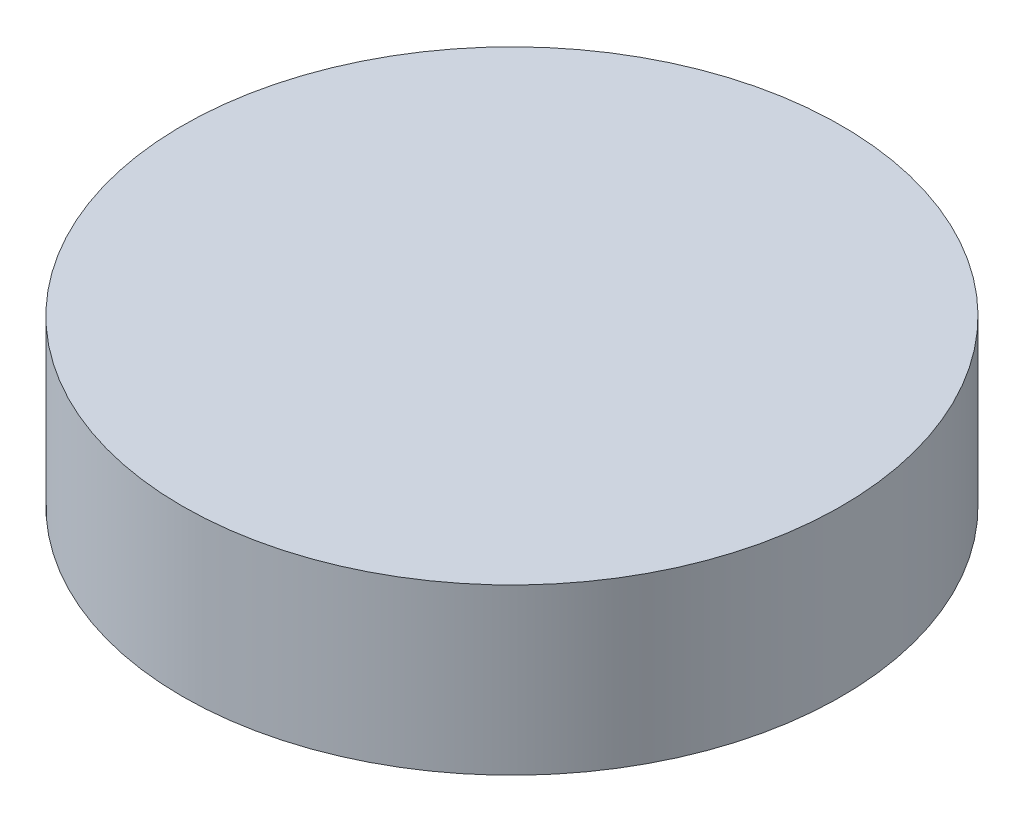
ISO-10303-21;
HEADER;
FILE_DESCRIPTION(('STEP AP214'),'2;1');
FILE_NAME('part.step','',(''),(''),'','','');
FILE_SCHEMA(('AUTOMOTIVE_DESIGN { 1 0 10303 214 1 1 1 1 }'));
ENDSEC;
DATA;
#1=APPLICATION_CONTEXT('core data for automotive mechanical design processes');
#2=APPLICATION_PROTOCOL_DEFINITION('international standard','automotive_design',2000,#1);
#3=PRODUCT_CONTEXT('',#1,'mechanical');
#4=PRODUCT('Part','Part','',(#3));
#5=PRODUCT_RELATED_PRODUCT_CATEGORY('part','',(#4));
#6=PRODUCT_DEFINITION_FORMATION('','',#4);
#7=PRODUCT_DEFINITION_CONTEXT('part definition',#1,'design');
#8=PRODUCT_DEFINITION('design','',#6,#7);
#9=PRODUCT_DEFINITION_SHAPE('','',#8);
#10=(LENGTH_UNIT() NAMED_UNIT(*) SI_UNIT(.MILLI.,.METRE.));
#11=(NAMED_UNIT(*) PLANE_ANGLE_UNIT() SI_UNIT($,.RADIAN.));
#12=(NAMED_UNIT(*) SI_UNIT($,.STERADIAN.) SOLID_ANGLE_UNIT());
#13=UNCERTAINTY_MEASURE_WITH_UNIT(LENGTH_MEASURE(1.E-05),#10,'distance_accuracy_value','');
#14=(GEOMETRIC_REPRESENTATION_CONTEXT(3) GLOBAL_UNCERTAINTY_ASSIGNED_CONTEXT((#13)) GLOBAL_UNIT_ASSIGNED_CONTEXT((#10,
#11,#12)) REPRESENTATION_CONTEXT('',''));
#15=CARTESIAN_POINT('',(0.,0.,0.));
#16=DIRECTION('',(0.,0.,1.));
#17=DIRECTION('',(1.,0.,0.));
#18=AXIS2_PLACEMENT_3D('',#15,#16,#17);
#19=CARTESIAN_POINT('',(0.,1.27,0.));
#20=DIRECTION('',(0.,-1.,0.));
#21=DIRECTION('',(0.,0.,-1.));
#22=AXIS2_PLACEMENT_3D('',#19,#20,#21);
#23=CYLINDRICAL_SURFACE('',#22,2.54);
#24=CARTESIAN_POINT('',(0.,1.27,0.));
#25=DIRECTION('',(0.,1.,0.));
#26=DIRECTION('',(0.,0.,1.));
#27=AXIS2_PLACEMENT_3D('',#24,#25,#26);
#28=CIRCLE('',#27,2.54);
#29=CARTESIAN_POINT('',(0.,1.27,2.54));
#30=VERTEX_POINT('',#29);
#31=EDGE_CURVE('E10',#30,#30,#28,.T.);
#32=ORIENTED_EDGE('',*,*,#31,.F.);
#33=EDGE_LOOP('',(#32));
#34=FACE_BOUND('',#33,.T.);
#35=CARTESIAN_POINT('',(0.,0.,0.));
#36=DIRECTION('',(0.,1.,0.));
#37=DIRECTION('',(0.,0.,1.));
#38=AXIS2_PLACEMENT_3D('',#35,#36,#37);
#39=CIRCLE('',#38,2.54);
#40=CARTESIAN_POINT('',(0.,0.,2.54));
#41=VERTEX_POINT('',#40);
#42=EDGE_CURVE('E35',#41,#41,#39,.T.);
#43=ORIENTED_EDGE('',*,*,#42,.T.);
#44=EDGE_LOOP('',(#43));
#45=FACE_BOUND('',#44,.T.);
#46=ADVANCED_FACE('F32',(#34,#45),#23,.T.);
#47=CARTESIAN_POINT('',(0.,1.27,0.));
#48=DIRECTION('',(0.,1.,0.));
#49=DIRECTION('',(0.,0.,1.));
#50=AXIS2_PLACEMENT_3D('',#47,#48,#49);
#51=PLANE('',#50);
#52=ORIENTED_EDGE('',*,*,#31,.T.);
#53=EDGE_LOOP('',(#52));
#54=FACE_BOUND('',#53,.T.);
#55=ADVANCED_FACE('F47',(#54),#51,.T.);
#56=CARTESIAN_POINT('',(0.,0.,0.));
#57=DIRECTION('',(0.,1.,0.));
#58=DIRECTION('',(0.,0.,1.));
#59=AXIS2_PLACEMENT_3D('',#56,#57,#58);
#60=PLANE('',#59);
#61=ORIENTED_EDGE('',*,*,#42,.F.);
#62=EDGE_LOOP('',(#61));
#63=FACE_BOUND('',#62,.T.);
#64=ADVANCED_FACE('F45',(#63),#60,.F.);
#65=CLOSED_SHELL('',(#46,#55,#64));
#66=MANIFOLD_SOLID_BREP('B2',#65);
#67=ADVANCED_BREP_SHAPE_REPRESENTATION('',(#18,#66),#14);
#68=SHAPE_DEFINITION_REPRESENTATION(#9,#67);
ENDSEC;
END-ISO-10303-21;
